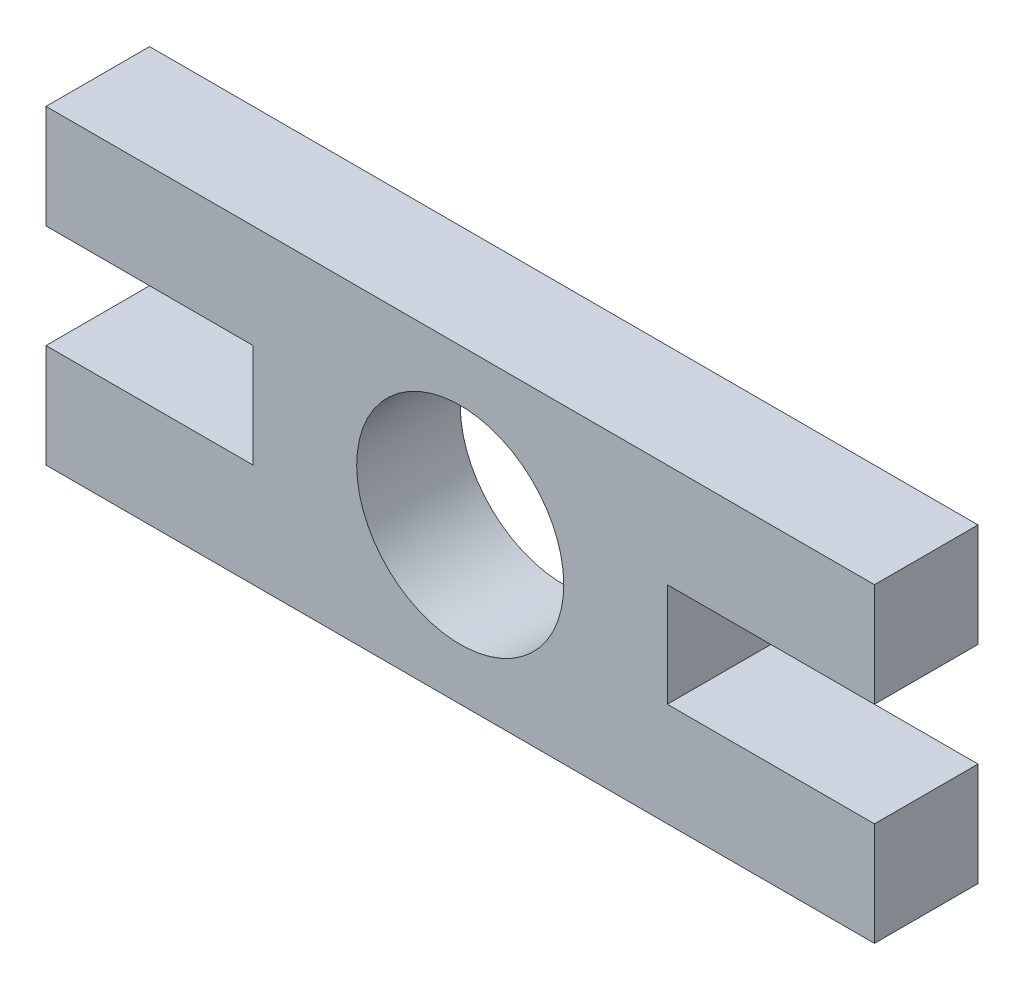
ISO-10303-21;
HEADER;
FILE_DESCRIPTION(('STEP AP214'),'2;1');
FILE_NAME('part.step','',(''),(''),'','','');
FILE_SCHEMA(('AUTOMOTIVE_DESIGN { 1 0 10303 214 1 1 1 1 }'));
ENDSEC;
DATA;
#1=APPLICATION_CONTEXT('core data for automotive mechanical design processes');
#2=APPLICATION_PROTOCOL_DEFINITION('international standard','automotive_design',2000,#1);
#3=PRODUCT_CONTEXT('',#1,'mechanical');
#4=PRODUCT('Part','Part','',(#3));
#5=PRODUCT_RELATED_PRODUCT_CATEGORY('part','',(#4));
#6=PRODUCT_DEFINITION_FORMATION('','',#4);
#7=PRODUCT_DEFINITION_CONTEXT('part definition',#1,'design');
#8=PRODUCT_DEFINITION('design','',#6,#7);
#9=PRODUCT_DEFINITION_SHAPE('','',#8);
#10=(LENGTH_UNIT() NAMED_UNIT(*) SI_UNIT(.MILLI.,.METRE.));
#11=(NAMED_UNIT(*) PLANE_ANGLE_UNIT() SI_UNIT($,.RADIAN.));
#12=(NAMED_UNIT(*) SI_UNIT($,.STERADIAN.) SOLID_ANGLE_UNIT());
#13=UNCERTAINTY_MEASURE_WITH_UNIT(LENGTH_MEASURE(1.E-05),#10,'distance_accuracy_value','');
#14=(GEOMETRIC_REPRESENTATION_CONTEXT(3) GLOBAL_UNCERTAINTY_ASSIGNED_CONTEXT((#13)) GLOBAL_UNIT_ASSIGNED_CONTEXT((#10,
#11,#12)) REPRESENTATION_CONTEXT('',''));
#15=CARTESIAN_POINT('',(0.,0.,0.));
#16=DIRECTION('',(0.,0.,1.));
#17=DIRECTION('',(1.,0.,0.));
#18=AXIS2_PLACEMENT_3D('',#15,#16,#17);
#19=CARTESIAN_POINT('',(-23.4141818181818,0.,-4.26412121212121));
#20=DIRECTION('',(1.,0.,0.));
#21=DIRECTION('',(0.,0.,-1.));
#22=AXIS2_PLACEMENT_3D('',#19,#20,#21);
#23=PLANE('',#22);
#24=DIRECTION('',(0.,-1.,0.));
#25=VECTOR('',#24,1.);
#26=CARTESIAN_POINT('',(-23.4141818181818,20.32,2.08587878787879));
#27=LINE('',#26,#25);
#28=CARTESIAN_POINT('',(-23.4141818181818,7.62,2.08587878787879));
#29=VERTEX_POINT('',#28);
#30=CARTESIAN_POINT('',(-23.4141818181818,1.27,2.08587878787879));
#31=VERTEX_POINT('',#30);
#32=EDGE_CURVE('E61',#29,#31,#27,.T.);
#33=ORIENTED_EDGE('',*,*,#32,.F.);
#34=DIRECTION('',(0.,0.,1.));
#35=VECTOR('',#34,1.);
#36=CARTESIAN_POINT('',(-23.4141818181818,7.62,-4.26412121212121));
#37=LINE('',#36,#35);
#38=CARTESIAN_POINT('',(-23.4141818181818,7.62,-4.26412121212121));
#39=VERTEX_POINT('',#38);
#40=EDGE_CURVE('E211',#39,#29,#37,.T.);
#41=ORIENTED_EDGE('',*,*,#40,.F.);
#42=DIRECTION('',(0.,1.,0.));
#43=VECTOR('',#42,1.);
#44=CARTESIAN_POINT('',(-23.4141818181818,0.,-4.26412121212121));
#45=LINE('',#44,#43);
#46=CARTESIAN_POINT('',(-23.4141818181818,1.27,-4.26412121212121));
#47=VERTEX_POINT('',#46);
#48=EDGE_CURVE('E200',#47,#39,#45,.T.);
#49=ORIENTED_EDGE('',*,*,#48,.F.);
#50=DIRECTION('',(0.,0.,-1.));
#51=VECTOR('',#50,1.);
#52=CARTESIAN_POINT('',(-23.4141818181818,1.27,8.43587878787879));
#53=LINE('',#52,#51);
#54=EDGE_CURVE('E163',#31,#47,#53,.T.);
#55=ORIENTED_EDGE('',*,*,#54,.F.);
#56=EDGE_LOOP('',(#33,#41,#49,#55));
#57=FACE_BOUND('',#56,.T.);
#58=ADVANCED_FACE('F45',(#57),#23,.F.);
#59=CARTESIAN_POINT('',(27.3858181818182,0.,-4.26412121212121));
#60=DIRECTION('',(-1.,0.,0.));
#61=DIRECTION('',(0.,0.,1.));
#62=AXIS2_PLACEMENT_3D('',#59,#60,#61);
#63=PLANE('',#62);
#64=DIRECTION('',(0.,1.,0.));
#65=VECTOR('',#64,1.);
#66=CARTESIAN_POINT('',(27.3858181818182,20.32,2.08587878787879));
#67=LINE('',#66,#65);
#68=CARTESIAN_POINT('',(27.3858181818182,1.27,2.08587878787879));
#69=VERTEX_POINT('',#68);
#70=CARTESIAN_POINT('',(27.3858181818182,7.62,2.08587878787879));
#71=VERTEX_POINT('',#70);
#72=EDGE_CURVE('E136',#69,#71,#67,.T.);
#73=ORIENTED_EDGE('',*,*,#72,.F.);
#74=DIRECTION('',(0.,0.,1.));
#75=VECTOR('',#74,1.);
#76=CARTESIAN_POINT('',(27.3858181818182,1.27,8.43587878787879));
#77=LINE('',#76,#75);
#78=CARTESIAN_POINT('',(27.3858181818182,1.27,-4.26412121212121));
#79=VERTEX_POINT('',#78);
#80=EDGE_CURVE('E147',#79,#69,#77,.T.);
#81=ORIENTED_EDGE('',*,*,#80,.F.);
#82=DIRECTION('',(0.,-1.,0.));
#83=VECTOR('',#82,1.);
#84=CARTESIAN_POINT('',(27.3858181818182,0.,-4.26412121212121));
#85=LINE('',#84,#83);
#86=CARTESIAN_POINT('',(27.3858181818182,7.62,-4.26412121212121));
#87=VERTEX_POINT('',#86);
#88=EDGE_CURVE('E176',#87,#79,#85,.T.);
#89=ORIENTED_EDGE('',*,*,#88,.F.);
#90=DIRECTION('',(0.,0.,1.));
#91=VECTOR('',#90,1.);
#92=CARTESIAN_POINT('',(27.3858181818182,7.62,-4.26412121212121));
#93=LINE('',#92,#91);
#94=EDGE_CURVE('E150',#87,#71,#93,.T.);
#95=ORIENTED_EDGE('',*,*,#94,.T.);
#96=EDGE_LOOP('',(#73,#81,#89,#95));
#97=FACE_BOUND('',#96,.T.);
#98=ADVANCED_FACE('F145',(#97),#63,.F.);
#99=CARTESIAN_POINT('',(-23.4141818181818,0.,-4.26412121212121));
#100=DIRECTION('',(-1.,0.,0.));
#101=DIRECTION('',(0.,0.,1.));
#102=AXIS2_PLACEMENT_3D('',#99,#100,#101);
#103=PLANE('',#102);
#104=DIRECTION('',(0.,0.,1.));
#105=VECTOR('',#104,1.);
#106=CARTESIAN_POINT('',(-23.4141818181818,13.97,-4.26412121212121));
#107=LINE('',#106,#105);
#108=CARTESIAN_POINT('',(-23.4141818181818,13.97,-4.26412121212121));
#109=VERTEX_POINT('',#108);
#110=CARTESIAN_POINT('',(-23.4141818181818,13.97,2.08587878787879));
#111=VERTEX_POINT('',#110);
#112=EDGE_CURVE('E225',#109,#111,#107,.T.);
#113=ORIENTED_EDGE('',*,*,#112,.T.);
#114=CARTESIAN_POINT('',(-23.4141818181818,20.32,2.08587878787879));
#115=VERTEX_POINT('',#114);
#116=EDGE_CURVE('E141',#115,#111,#27,.T.);
#117=ORIENTED_EDGE('',*,*,#116,.F.);
#118=DIRECTION('',(0.,0.,1.));
#119=VECTOR('',#118,1.);
#120=CARTESIAN_POINT('',(-23.4141818181818,20.32,-4.26412121212121));
#121=LINE('',#120,#119);
#122=CARTESIAN_POINT('',(-23.4141818181818,20.32,-4.26412121212121));
#123=VERTEX_POINT('',#122);
#124=EDGE_CURVE('E156',#123,#115,#121,.T.);
#125=ORIENTED_EDGE('',*,*,#124,.F.);
#126=DIRECTION('',(0.,-1.,0.));
#127=VECTOR('',#126,1.);
#128=CARTESIAN_POINT('',(-23.4141818181818,0.,-4.26412121212121));
#129=LINE('',#128,#127);
#130=EDGE_CURVE('E215',#123,#109,#129,.T.);
#131=ORIENTED_EDGE('',*,*,#130,.T.);
#132=EDGE_LOOP('',(#113,#117,#125,#131));
#133=FACE_BOUND('',#132,.T.);
#134=ADVANCED_FACE('F293',(#133),#103,.T.);
#135=CARTESIAN_POINT('',(27.3858181818182,0.,-4.26412121212121));
#136=DIRECTION('',(-1.,0.,0.));
#137=DIRECTION('',(0.,0.,1.));
#138=AXIS2_PLACEMENT_3D('',#135,#136,#137);
#139=PLANE('',#138);
#140=CARTESIAN_POINT('',(27.3858181818182,13.97,2.08587878787879));
#141=VERTEX_POINT('',#140);
#142=CARTESIAN_POINT('',(27.3858181818182,20.32,2.08587878787879));
#143=VERTEX_POINT('',#142);
#144=EDGE_CURVE('E140',#141,#143,#67,.T.);
#145=ORIENTED_EDGE('',*,*,#144,.F.);
#146=DIRECTION('',(0.,0.,1.));
#147=VECTOR('',#146,1.);
#148=CARTESIAN_POINT('',(27.3858181818182,13.97,-4.26412121212121));
#149=LINE('',#148,#147);
#150=CARTESIAN_POINT('',(27.3858181818182,13.97,-4.26412121212121));
#151=VERTEX_POINT('',#150);
#152=EDGE_CURVE('E196',#151,#141,#149,.T.);
#153=ORIENTED_EDGE('',*,*,#152,.F.);
#154=DIRECTION('',(0.,-1.,0.));
#155=VECTOR('',#154,1.);
#156=CARTESIAN_POINT('',(27.3858181818182,0.,-4.26412121212121));
#157=LINE('',#156,#155);
#158=CARTESIAN_POINT('',(27.3858181818182,20.32,-4.26412121212121));
#159=VERTEX_POINT('',#158);
#160=EDGE_CURVE('E186',#159,#151,#157,.T.);
#161=ORIENTED_EDGE('',*,*,#160,.F.);
#162=DIRECTION('',(0.,0.,-1.));
#163=VECTOR('',#162,1.);
#164=CARTESIAN_POINT('',(27.3858181818182,20.32,-4.26412121212121));
#165=LINE('',#164,#163);
#166=EDGE_CURVE('E161',#143,#159,#165,.T.);
#167=ORIENTED_EDGE('',*,*,#166,.F.);
#168=EDGE_LOOP('',(#145,#153,#161,#167));
#169=FACE_BOUND('',#168,.T.);
#170=ADVANCED_FACE('F288',(#169),#139,.F.);
#171=CARTESIAN_POINT('',(14.6858181818182,21.59,-4.26412121212121));
#172=DIRECTION('',(-1.,0.,0.));
#173=DIRECTION('',(0.,0.,1.));
#174=AXIS2_PLACEMENT_3D('',#171,#172,#173);
#175=PLANE('',#174);
#176=DIRECTION('',(0.,1.,0.));
#177=VECTOR('',#176,1.);
#178=CARTESIAN_POINT('',(14.6858181818182,21.59,2.08587878787879));
#179=LINE('',#178,#177);
#180=CARTESIAN_POINT('',(14.6858181818182,7.62,2.08587878787879));
#181=VERTEX_POINT('',#180);
#182=CARTESIAN_POINT('',(14.6858181818182,13.97,2.08587878787879));
#183=VERTEX_POINT('',#182);
#184=EDGE_CURVE('E261',#181,#183,#179,.T.);
#185=ORIENTED_EDGE('',*,*,#184,.F.);
#186=DIRECTION('',(0.,0.,1.));
#187=VECTOR('',#186,1.);
#188=CARTESIAN_POINT('',(14.6858181818182,7.62,-4.26412121212121));
#189=LINE('',#188,#187);
#190=CARTESIAN_POINT('',(14.6858181818182,7.62,-4.26412121212121));
#191=VERTEX_POINT('',#190);
#192=EDGE_CURVE('E182',#191,#181,#189,.T.);
#193=ORIENTED_EDGE('',*,*,#192,.F.);
#194=DIRECTION('',(0.,-1.,0.));
#195=VECTOR('',#194,1.);
#196=CARTESIAN_POINT('',(14.6858181818182,21.59,-4.26412121212121));
#197=LINE('',#196,#195);
#198=CARTESIAN_POINT('',(14.6858181818182,13.97,-4.26412121212121));
#199=VERTEX_POINT('',#198);
#200=EDGE_CURVE('E11',#199,#191,#197,.T.);
#201=ORIENTED_EDGE('',*,*,#200,.F.);
#202=DIRECTION('',(0.,0.,1.));
#203=VECTOR('',#202,1.);
#204=CARTESIAN_POINT('',(14.6858181818182,13.97,-4.26412121212121));
#205=LINE('',#204,#203);
#206=EDGE_CURVE('E195',#199,#183,#205,.T.);
#207=ORIENTED_EDGE('',*,*,#206,.T.);
#208=EDGE_LOOP('',(#185,#193,#201,#207));
#209=FACE_BOUND('',#208,.T.);
#210=ADVANCED_FACE('F306',(#209),#175,.F.);
#211=CARTESIAN_POINT('',(-10.7141818181818,21.59,-4.26412121212121));
#212=DIRECTION('',(1.,0.,0.));
#213=DIRECTION('',(0.,0.,-1.));
#214=AXIS2_PLACEMENT_3D('',#211,#212,#213);
#215=PLANE('',#214);
#216=DIRECTION('',(0.,-1.,0.));
#217=VECTOR('',#216,1.);
#218=CARTESIAN_POINT('',(-10.7141818181818,21.59,2.08587878787879));
#219=LINE('',#218,#217);
#220=CARTESIAN_POINT('',(-10.7141818181818,13.97,2.08587878787879));
#221=VERTEX_POINT('',#220);
#222=CARTESIAN_POINT('',(-10.7141818181818,7.62,2.08587878787879));
#223=VERTEX_POINT('',#222);
#224=EDGE_CURVE('E270',#221,#223,#219,.T.);
#225=ORIENTED_EDGE('',*,*,#224,.F.);
#226=DIRECTION('',(0.,0.,1.));
#227=VECTOR('',#226,1.);
#228=CARTESIAN_POINT('',(-10.7141818181818,13.97,-4.26412121212121));
#229=LINE('',#228,#227);
#230=CARTESIAN_POINT('',(-10.7141818181818,13.97,-4.26412121212121));
#231=VERTEX_POINT('',#230);
#232=EDGE_CURVE('E226',#231,#221,#229,.T.);
#233=ORIENTED_EDGE('',*,*,#232,.F.);
#234=DIRECTION('',(0.,-1.,0.));
#235=VECTOR('',#234,1.);
#236=CARTESIAN_POINT('',(-10.7141818181818,21.59,-4.26412121212121));
#237=LINE('',#236,#235);
#238=CARTESIAN_POINT('',(-10.7141818181818,7.62,-4.26412121212121));
#239=VERTEX_POINT('',#238);
#240=EDGE_CURVE('E54',#231,#239,#237,.T.);
#241=ORIENTED_EDGE('',*,*,#240,.T.);
#242=DIRECTION('',(0.,0.,1.));
#243=VECTOR('',#242,1.);
#244=CARTESIAN_POINT('',(-10.7141818181818,7.62,-4.26412121212121));
#245=LINE('',#244,#243);
#246=EDGE_CURVE('E210',#239,#223,#245,.T.);
#247=ORIENTED_EDGE('',*,*,#246,.T.);
#248=EDGE_LOOP('',(#225,#233,#241,#247));
#249=FACE_BOUND('',#248,.T.);
#250=ADVANCED_FACE('F47',(#249),#215,.F.);
#251=CARTESIAN_POINT('',(0.,13.97,-4.26412121212121));
#252=DIRECTION('',(0.,1.,0.));
#253=DIRECTION('',(0.,0.,1.));
#254=AXIS2_PLACEMENT_3D('',#251,#252,#253);
#255=PLANE('',#254);
#256=DIRECTION('',(1.,0.,0.));
#257=VECTOR('',#256,1.);
#258=CARTESIAN_POINT('',(0.,13.97,2.08587878787879));
#259=LINE('',#258,#257);
#260=EDGE_CURVE('E273',#111,#221,#259,.T.);
#261=ORIENTED_EDGE('',*,*,#260,.F.);
#262=ORIENTED_EDGE('',*,*,#112,.F.);
#263=DIRECTION('',(-1.,0.,0.));
#264=VECTOR('',#263,1.);
#265=CARTESIAN_POINT('',(0.,13.97,-4.26412121212121));
#266=LINE('',#265,#264);
#267=EDGE_CURVE('E221',#231,#109,#266,.T.);
#268=ORIENTED_EDGE('',*,*,#267,.F.);
#269=ORIENTED_EDGE('',*,*,#232,.T.);
#270=EDGE_LOOP('',(#261,#262,#268,#269));
#271=FACE_BOUND('',#270,.T.);
#272=ADVANCED_FACE('F297',(#271),#255,.F.);
#273=CARTESIAN_POINT('',(0.,7.62,-4.26412121212121));
#274=DIRECTION('',(0.,1.,0.));
#275=DIRECTION('',(-1.,0.,0.));
#276=AXIS2_PLACEMENT_3D('',#273,#274,#275);
#277=PLANE('',#276);
#278=ORIENTED_EDGE('',*,*,#40,.T.);
#279=DIRECTION('',(1.,0.,0.));
#280=VECTOR('',#279,1.);
#281=CARTESIAN_POINT('',(0.,7.62,2.08587878787879));
#282=LINE('',#281,#280);
#283=EDGE_CURVE('E243',#29,#223,#282,.T.);
#284=ORIENTED_EDGE('',*,*,#283,.T.);
#285=ORIENTED_EDGE('',*,*,#246,.F.);
#286=DIRECTION('',(-1.,0.,0.));
#287=VECTOR('',#286,1.);
#288=CARTESIAN_POINT('',(0.,7.62,-4.26412121212121));
#289=LINE('',#288,#287);
#290=EDGE_CURVE('E206',#239,#39,#289,.T.);
#291=ORIENTED_EDGE('',*,*,#290,.T.);
#292=EDGE_LOOP('',(#278,#284,#285,#291));
#293=FACE_BOUND('',#292,.T.);
#294=ADVANCED_FACE('F242',(#293),#277,.T.);
#295=CARTESIAN_POINT('',(0.,13.97,-4.26412121212121));
#296=DIRECTION('',(0.,-1.,0.));
#297=DIRECTION('',(0.,0.,-1.));
#298=AXIS2_PLACEMENT_3D('',#295,#296,#297);
#299=PLANE('',#298);
#300=ORIENTED_EDGE('',*,*,#152,.T.);
#301=DIRECTION('',(-1.,0.,0.));
#302=VECTOR('',#301,1.);
#303=CARTESIAN_POINT('',(0.,13.97,2.08587878787879));
#304=LINE('',#303,#302);
#305=EDGE_CURVE('E264',#141,#183,#304,.T.);
#306=ORIENTED_EDGE('',*,*,#305,.T.);
#307=ORIENTED_EDGE('',*,*,#206,.F.);
#308=DIRECTION('',(1.,0.,0.));
#309=VECTOR('',#308,1.);
#310=CARTESIAN_POINT('',(0.,13.97,-4.26412121212121));
#311=LINE('',#310,#309);
#312=EDGE_CURVE('E191',#199,#151,#311,.T.);
#313=ORIENTED_EDGE('',*,*,#312,.T.);
#314=EDGE_LOOP('',(#300,#306,#307,#313));
#315=FACE_BOUND('',#314,.T.);
#316=ADVANCED_FACE('F304',(#315),#299,.T.);
#317=CARTESIAN_POINT('',(0.,7.62,-4.26412121212121));
#318=DIRECTION('',(0.,-1.,0.));
#319=DIRECTION('',(0.,0.,-1.));
#320=AXIS2_PLACEMENT_3D('',#317,#318,#319);
#321=PLANE('',#320);
#322=DIRECTION('',(-1.,0.,0.));
#323=VECTOR('',#322,1.);
#324=CARTESIAN_POINT('',(0.,7.62,2.08587878787879));
#325=LINE('',#324,#323);
#326=EDGE_CURVE('E258',#71,#181,#325,.T.);
#327=ORIENTED_EDGE('',*,*,#326,.F.);
#328=ORIENTED_EDGE('',*,*,#94,.F.);
#329=DIRECTION('',(1.,0.,0.));
#330=VECTOR('',#329,1.);
#331=CARTESIAN_POINT('',(0.,7.62,-4.26412121212121));
#332=LINE('',#331,#330);
#333=EDGE_CURVE('E179',#191,#87,#332,.T.);
#334=ORIENTED_EDGE('',*,*,#333,.F.);
#335=ORIENTED_EDGE('',*,*,#192,.T.);
#336=EDGE_LOOP('',(#327,#328,#334,#335));
#337=FACE_BOUND('',#336,.T.);
#338=ADVANCED_FACE('F318',(#337),#321,.F.);
#339=CARTESIAN_POINT('',(1.98581818181818,10.795,-4.26412121212121));
#340=DIRECTION('',(0.,0.,1.));
#341=DIRECTION('',(1.,0.,0.));
#342=AXIS2_PLACEMENT_3D('',#339,#340,#341);
#343=CYLINDRICAL_SURFACE('',#342,6.35);
#344=CARTESIAN_POINT('',(1.98581818181818,10.795,-4.26412121212121));
#345=DIRECTION('',(0.,0.,1.));
#346=DIRECTION('',(1.,0.,0.));
#347=AXIS2_PLACEMENT_3D('',#344,#345,#346);
#348=CIRCLE('',#347,6.35);
#349=CARTESIAN_POINT('',(8.33581818181818,10.795,-4.26412121212121));
#350=VERTEX_POINT('',#349);
#351=EDGE_CURVE('E172',#350,#350,#348,.T.);
#352=ORIENTED_EDGE('',*,*,#351,.F.);
#353=EDGE_LOOP('',(#352));
#354=FACE_BOUND('',#353,.T.);
#355=CARTESIAN_POINT('',(1.98581818181818,10.795,2.08587878787879));
#356=DIRECTION('',(0.,0.,1.));
#357=DIRECTION('',(1.,0.,0.));
#358=AXIS2_PLACEMENT_3D('',#355,#356,#357);
#359=CIRCLE('',#358,6.35);
#360=CARTESIAN_POINT('',(8.33581818181818,10.795,2.08587878787879));
#361=VERTEX_POINT('',#360);
#362=EDGE_CURVE('E254',#361,#361,#359,.F.);
#363=ORIENTED_EDGE('',*,*,#362,.F.);
#364=EDGE_LOOP('',(#363));
#365=FACE_BOUND('',#364,.T.);
#366=ADVANCED_FACE('F323',(#354,#365),#343,.F.);
#367=CARTESIAN_POINT('',(0.,20.32,0.));
#368=DIRECTION('',(0.,1.,0.));
#369=DIRECTION('',(0.,0.,1.));
#370=AXIS2_PLACEMENT_3D('',#367,#368,#369);
#371=PLANE('',#370);
#372=ORIENTED_EDGE('',*,*,#124,.T.);
#373=DIRECTION('',(-1.,0.,0.));
#374=VECTOR('',#373,1.);
#375=CARTESIAN_POINT('',(-23.4141818181818,20.32,2.08587878787879));
#376=LINE('',#375,#374);
#377=EDGE_CURVE('E152',#143,#115,#376,.T.);
#378=ORIENTED_EDGE('',*,*,#377,.F.);
#379=ORIENTED_EDGE('',*,*,#166,.T.);
#380=DIRECTION('',(-1.,0.,0.));
#381=VECTOR('',#380,1.);
#382=CARTESIAN_POINT('',(-23.4141818181818,20.32,-4.26412121212121));
#383=LINE('',#382,#381);
#384=EDGE_CURVE('E169',#159,#123,#383,.T.);
#385=ORIENTED_EDGE('',*,*,#384,.T.);
#386=EDGE_LOOP('',(#372,#378,#379,#385));
#387=FACE_BOUND('',#386,.T.);
#388=ADVANCED_FACE('F284',(#387),#371,.T.);
#389=CARTESIAN_POINT('',(0.,1.27,0.));
#390=DIRECTION('',(0.,-1.,0.));
#391=DIRECTION('',(0.,0.,-1.));
#392=AXIS2_PLACEMENT_3D('',#389,#390,#391);
#393=PLANE('',#392);
#394=ORIENTED_EDGE('',*,*,#80,.T.);
#395=DIRECTION('',(1.,0.,0.));
#396=VECTOR('',#395,1.);
#397=CARTESIAN_POINT('',(-23.4141818181818,1.27,2.08587878787879));
#398=LINE('',#397,#396);
#399=EDGE_CURVE('E133',#31,#69,#398,.T.);
#400=ORIENTED_EDGE('',*,*,#399,.F.);
#401=ORIENTED_EDGE('',*,*,#54,.T.);
#402=DIRECTION('',(1.,0.,0.));
#403=VECTOR('',#402,1.);
#404=CARTESIAN_POINT('',(-23.4141818181818,1.27,-4.26412121212121));
#405=LINE('',#404,#403);
#406=EDGE_CURVE('E69',#47,#79,#405,.T.);
#407=ORIENTED_EDGE('',*,*,#406,.T.);
#408=EDGE_LOOP('',(#394,#400,#401,#407));
#409=FACE_BOUND('',#408,.T.);
#410=ADVANCED_FACE('F154',(#409),#393,.T.);
#411=CARTESIAN_POINT('',(-10.7141818181818,21.59,-4.26412121212121));
#412=DIRECTION('',(0.,0.,1.));
#413=DIRECTION('',(1.,0.,0.));
#414=AXIS2_PLACEMENT_3D('',#411,#412,#413);
#415=PLANE('',#414);
#416=ORIENTED_EDGE('',*,*,#351,.T.);
#417=EDGE_LOOP('',(#416));
#418=FACE_BOUND('',#417,.T.);
#419=ORIENTED_EDGE('',*,*,#406,.F.);
#420=ORIENTED_EDGE('',*,*,#48,.T.);
#421=ORIENTED_EDGE('',*,*,#290,.F.);
#422=ORIENTED_EDGE('',*,*,#240,.F.);
#423=ORIENTED_EDGE('',*,*,#267,.T.);
#424=ORIENTED_EDGE('',*,*,#130,.F.);
#425=ORIENTED_EDGE('',*,*,#384,.F.);
#426=ORIENTED_EDGE('',*,*,#160,.T.);
#427=ORIENTED_EDGE('',*,*,#312,.F.);
#428=ORIENTED_EDGE('',*,*,#200,.T.);
#429=ORIENTED_EDGE('',*,*,#333,.T.);
#430=ORIENTED_EDGE('',*,*,#88,.T.);
#431=EDGE_LOOP('',(#419,#420,#421,#422,#423,#424,#425,#426,#427,#428,#429,#430));
#432=FACE_BOUND('',#431,.T.);
#433=ADVANCED_FACE('F244',(#418,#432),#415,.F.);
#434=CARTESIAN_POINT('',(0.,0.,2.08587878787879));
#435=DIRECTION('',(0.,0.,1.));
#436=DIRECTION('',(1.,0.,0.));
#437=AXIS2_PLACEMENT_3D('',#434,#435,#436);
#438=PLANE('',#437);
#439=ORIENTED_EDGE('',*,*,#362,.T.);
#440=EDGE_LOOP('',(#439));
#441=FACE_BOUND('',#440,.T.);
#442=ORIENTED_EDGE('',*,*,#260,.T.);
#443=ORIENTED_EDGE('',*,*,#224,.T.);
#444=ORIENTED_EDGE('',*,*,#283,.F.);
#445=ORIENTED_EDGE('',*,*,#32,.T.);
#446=ORIENTED_EDGE('',*,*,#399,.T.);
#447=ORIENTED_EDGE('',*,*,#72,.T.);
#448=ORIENTED_EDGE('',*,*,#326,.T.);
#449=ORIENTED_EDGE('',*,*,#184,.T.);
#450=ORIENTED_EDGE('',*,*,#305,.F.);
#451=ORIENTED_EDGE('',*,*,#144,.T.);
#452=ORIENTED_EDGE('',*,*,#377,.T.);
#453=ORIENTED_EDGE('',*,*,#116,.T.);
#454=EDGE_LOOP('',(#442,#443,#444,#445,#446,#447,#448,#449,#450,#451,#452,#453));
#455=FACE_BOUND('',#454,.T.);
#456=ADVANCED_FACE('F135',(#441,#455),#438,.T.);
#457=CLOSED_SHELL('',(#58,#98,#134,#170,#210,#250,#272,#294,#316,#338,#366,#388,#410,#433,#456));
#458=MANIFOLD_SOLID_BREP('B2',#457);
#459=ADVANCED_BREP_SHAPE_REPRESENTATION('',(#18,#458),#14);
#460=SHAPE_DEFINITION_REPRESENTATION(#9,#459);
ENDSEC;
END-ISO-10303-21;
